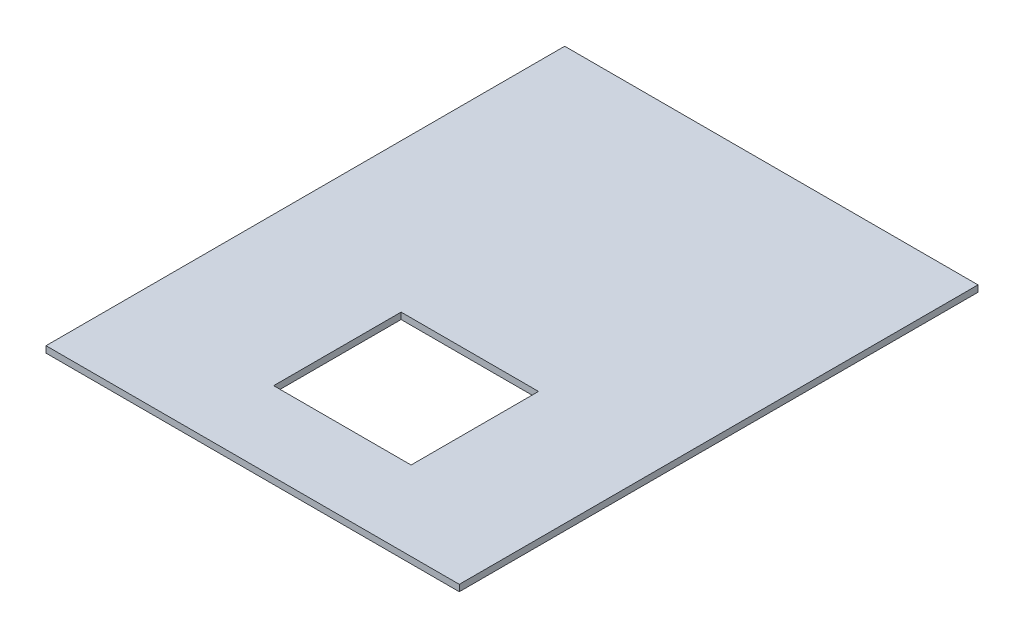
ISO-10303-21;
HEADER;
FILE_DESCRIPTION(('STEP AP214'),'2;1');
FILE_NAME('part.step','',(''),(''),'','','');
FILE_SCHEMA(('AUTOMOTIVE_DESIGN { 1 0 10303 214 1 1 1 1 }'));
ENDSEC;
DATA;
#1=APPLICATION_CONTEXT('core data for automotive mechanical design processes');
#2=APPLICATION_PROTOCOL_DEFINITION('international standard','automotive_design',2000,#1);
#3=PRODUCT_CONTEXT('',#1,'mechanical');
#4=PRODUCT('Part','Part','',(#3));
#5=PRODUCT_RELATED_PRODUCT_CATEGORY('part','',(#4));
#6=PRODUCT_DEFINITION_FORMATION('','',#4);
#7=PRODUCT_DEFINITION_CONTEXT('part definition',#1,'design');
#8=PRODUCT_DEFINITION('design','',#6,#7);
#9=PRODUCT_DEFINITION_SHAPE('','',#8);
#10=(LENGTH_UNIT() NAMED_UNIT(*) SI_UNIT(.MILLI.,.METRE.));
#11=(NAMED_UNIT(*) PLANE_ANGLE_UNIT() SI_UNIT($,.RADIAN.));
#12=(NAMED_UNIT(*) SI_UNIT($,.STERADIAN.) SOLID_ANGLE_UNIT());
#13=UNCERTAINTY_MEASURE_WITH_UNIT(LENGTH_MEASURE(1.E-05),#10,'distance_accuracy_value','');
#14=(GEOMETRIC_REPRESENTATION_CONTEXT(3) GLOBAL_UNCERTAINTY_ASSIGNED_CONTEXT((#13)) GLOBAL_UNIT_ASSIGNED_CONTEXT((#10,
#11,#12)) REPRESENTATION_CONTEXT('',''));
#15=CARTESIAN_POINT('',(0.,0.,0.));
#16=DIRECTION('',(0.,0.,1.));
#17=DIRECTION('',(1.,0.,0.));
#18=AXIS2_PLACEMENT_3D('',#15,#16,#17);
#19=CARTESIAN_POINT('',(0.,4.7625,0.));
#20=DIRECTION('',(0.,1.,0.));
#21=DIRECTION('',(0.,0.,1.));
#22=AXIS2_PLACEMENT_3D('',#19,#20,#21);
#23=PLANE('',#22);
#24=DIRECTION('',(0.,0.,1.));
#25=VECTOR('',#24,1.);
#26=CARTESIAN_POINT('',(-152.4,4.7625,-191.262));
#27=LINE('',#26,#25);
#28=CARTESIAN_POINT('',(-152.4,4.7625,-191.262));
#29=VERTEX_POINT('',#28);
#30=CARTESIAN_POINT('',(-152.4,4.7625,191.262));
#31=VERTEX_POINT('',#30);
#32=EDGE_CURVE('E134',#29,#31,#27,.T.);
#33=ORIENTED_EDGE('',*,*,#32,.T.);
#34=DIRECTION('',(1.,0.,0.));
#35=VECTOR('',#34,1.);
#36=CARTESIAN_POINT('',(-152.4,4.7625,191.262));
#37=LINE('',#36,#35);
#38=CARTESIAN_POINT('',(152.4,4.7625,191.262));
#39=VERTEX_POINT('',#38);
#40=EDGE_CURVE('E137',#31,#39,#37,.T.);
#41=ORIENTED_EDGE('',*,*,#40,.T.);
#42=DIRECTION('',(0.,0.,-1.));
#43=VECTOR('',#42,1.);
#44=CARTESIAN_POINT('',(152.4,4.7625,-191.262));
#45=LINE('',#44,#43);
#46=CARTESIAN_POINT('',(152.4,4.7625,-191.262));
#47=VERTEX_POINT('',#46);
#48=EDGE_CURVE('E140',#39,#47,#45,.T.);
#49=ORIENTED_EDGE('',*,*,#48,.T.);
#50=DIRECTION('',(-1.,0.,0.));
#51=VECTOR('',#50,1.);
#52=CARTESIAN_POINT('',(-152.4,4.7625,-191.262));
#53=LINE('',#52,#51);
#54=EDGE_CURVE('E142',#47,#29,#53,.T.);
#55=ORIENTED_EDGE('',*,*,#54,.T.);
#56=EDGE_LOOP('',(#33,#41,#49,#55));
#57=FACE_BOUND('',#56,.T.);
#58=DIRECTION('',(1.,0.,0.));
#59=VECTOR('',#58,1.);
#60=CARTESIAN_POINT('',(-42.926,4.7625,132.842));
#61=LINE('',#60,#59);
#62=CARTESIAN_POINT('',(-42.926,4.7625,132.842));
#63=VERTEX_POINT('',#62);
#64=CARTESIAN_POINT('',(58.42,4.7625,132.842));
#65=VERTEX_POINT('',#64);
#66=EDGE_CURVE('E106',#63,#65,#61,.T.);
#67=ORIENTED_EDGE('',*,*,#66,.F.);
#68=DIRECTION('',(0.,0.,1.));
#69=VECTOR('',#68,1.);
#70=CARTESIAN_POINT('',(-42.9260000000001,4.7625,38.862));
#71=LINE('',#70,#69);
#72=CARTESIAN_POINT('',(-42.9260000000001,4.7625,38.862));
#73=VERTEX_POINT('',#72);
#74=EDGE_CURVE('E98',#73,#63,#71,.T.);
#75=ORIENTED_EDGE('',*,*,#74,.F.);
#76=DIRECTION('',(-1.,0.,0.));
#77=VECTOR('',#76,1.);
#78=CARTESIAN_POINT('',(-42.9260000000001,4.7625,38.862));
#79=LINE('',#78,#77);
#80=CARTESIAN_POINT('',(58.42,4.7625,38.862));
#81=VERTEX_POINT('',#80);
#82=EDGE_CURVE('E120',#81,#73,#79,.T.);
#83=ORIENTED_EDGE('',*,*,#82,.F.);
#84=DIRECTION('',(0.,0.,-1.));
#85=VECTOR('',#84,1.);
#86=CARTESIAN_POINT('',(58.42,4.7625,38.862));
#87=LINE('',#86,#85);
#88=EDGE_CURVE('E118',#65,#81,#87,.T.);
#89=ORIENTED_EDGE('',*,*,#88,.F.);
#90=EDGE_LOOP('',(#67,#75,#83,#89));
#91=FACE_BOUND('',#90,.T.);
#92=ADVANCED_FACE('F33',(#57,#91),#23,.T.);
#93=CARTESIAN_POINT('',(0.,0.,0.));
#94=DIRECTION('',(0.,1.,0.));
#95=DIRECTION('',(0.,0.,1.));
#96=AXIS2_PLACEMENT_3D('',#93,#94,#95);
#97=PLANE('',#96);
#98=DIRECTION('',(0.,0.,1.));
#99=VECTOR('',#98,1.);
#100=CARTESIAN_POINT('',(-152.4,0.,-191.262));
#101=LINE('',#100,#99);
#102=CARTESIAN_POINT('',(-152.4,0.,-191.262));
#103=VERTEX_POINT('',#102);
#104=CARTESIAN_POINT('',(-152.4,0.,191.262));
#105=VERTEX_POINT('',#104);
#106=EDGE_CURVE('E114',#103,#105,#101,.T.);
#107=ORIENTED_EDGE('',*,*,#106,.F.);
#108=DIRECTION('',(-1.,0.,0.));
#109=VECTOR('',#108,1.);
#110=CARTESIAN_POINT('',(-152.4,0.,-191.262));
#111=LINE('',#110,#109);
#112=CARTESIAN_POINT('',(152.4,0.,-191.262));
#113=VERTEX_POINT('',#112);
#114=EDGE_CURVE('E138',#113,#103,#111,.T.);
#115=ORIENTED_EDGE('',*,*,#114,.F.);
#116=DIRECTION('',(0.,0.,-1.));
#117=VECTOR('',#116,1.);
#118=CARTESIAN_POINT('',(152.4,0.,-191.262));
#119=LINE('',#118,#117);
#120=CARTESIAN_POINT('',(152.4,0.,191.262));
#121=VERTEX_POINT('',#120);
#122=EDGE_CURVE('E149',#121,#113,#119,.T.);
#123=ORIENTED_EDGE('',*,*,#122,.F.);
#124=DIRECTION('',(1.,0.,0.));
#125=VECTOR('',#124,1.);
#126=CARTESIAN_POINT('',(-152.4,0.,191.262));
#127=LINE('',#126,#125);
#128=EDGE_CURVE('E147',#105,#121,#127,.T.);
#129=ORIENTED_EDGE('',*,*,#128,.F.);
#130=EDGE_LOOP('',(#107,#115,#123,#129));
#131=FACE_BOUND('',#130,.T.);
#132=DIRECTION('',(0.,0.,1.));
#133=VECTOR('',#132,1.);
#134=CARTESIAN_POINT('',(-42.9260000000001,0.,38.862));
#135=LINE('',#134,#133);
#136=CARTESIAN_POINT('',(-42.9260000000001,0.,38.862));
#137=VERTEX_POINT('',#136);
#138=CARTESIAN_POINT('',(-42.926,0.,132.842));
#139=VERTEX_POINT('',#138);
#140=EDGE_CURVE('E56',#137,#139,#135,.T.);
#141=ORIENTED_EDGE('',*,*,#140,.T.);
#142=DIRECTION('',(1.,0.,0.));
#143=VECTOR('',#142,1.);
#144=CARTESIAN_POINT('',(-42.926,0.,132.842));
#145=LINE('',#144,#143);
#146=CARTESIAN_POINT('',(58.42,0.,132.842));
#147=VERTEX_POINT('',#146);
#148=EDGE_CURVE('E113',#139,#147,#145,.T.);
#149=ORIENTED_EDGE('',*,*,#148,.T.);
#150=DIRECTION('',(0.,0.,-1.));
#151=VECTOR('',#150,1.);
#152=CARTESIAN_POINT('',(58.42,0.,38.862));
#153=LINE('',#152,#151);
#154=CARTESIAN_POINT('',(58.42,0.,38.862));
#155=VERTEX_POINT('',#154);
#156=EDGE_CURVE('E126',#147,#155,#153,.T.);
#157=ORIENTED_EDGE('',*,*,#156,.T.);
#158=DIRECTION('',(-1.,0.,0.));
#159=VECTOR('',#158,1.);
#160=CARTESIAN_POINT('',(-42.9260000000001,0.,38.862));
#161=LINE('',#160,#159);
#162=EDGE_CURVE('E107',#155,#137,#161,.T.);
#163=ORIENTED_EDGE('',*,*,#162,.T.);
#164=EDGE_LOOP('',(#141,#149,#157,#163));
#165=FACE_BOUND('',#164,.T.);
#166=ADVANCED_FACE('F167',(#131,#165),#97,.F.);
#167=CARTESIAN_POINT('',(-152.4,4.7625,-191.262));
#168=DIRECTION('',(1.,0.,0.));
#169=DIRECTION('',(0.,0.,-1.));
#170=AXIS2_PLACEMENT_3D('',#167,#168,#169);
#171=PLANE('',#170);
#172=ORIENTED_EDGE('',*,*,#106,.T.);
#173=DIRECTION('',(0.,-1.,0.));
#174=VECTOR('',#173,1.);
#175=CARTESIAN_POINT('',(-152.4,4.7625,191.262));
#176=LINE('',#175,#174);
#177=EDGE_CURVE('E11',#31,#105,#176,.T.);
#178=ORIENTED_EDGE('',*,*,#177,.F.);
#179=ORIENTED_EDGE('',*,*,#32,.F.);
#180=DIRECTION('',(0.,-1.,0.));
#181=VECTOR('',#180,1.);
#182=CARTESIAN_POINT('',(-152.4,4.7625,-191.262));
#183=LINE('',#182,#181);
#184=EDGE_CURVE('E144',#29,#103,#183,.T.);
#185=ORIENTED_EDGE('',*,*,#184,.T.);
#186=EDGE_LOOP('',(#172,#178,#179,#185));
#187=FACE_BOUND('',#186,.T.);
#188=ADVANCED_FACE('F35',(#187),#171,.F.);
#189=CARTESIAN_POINT('',(-152.4,4.7625,191.262));
#190=DIRECTION('',(0.,0.,-1.));
#191=DIRECTION('',(-1.,0.,0.));
#192=AXIS2_PLACEMENT_3D('',#189,#190,#191);
#193=PLANE('',#192);
#194=ORIENTED_EDGE('',*,*,#128,.T.);
#195=DIRECTION('',(0.,-1.,0.));
#196=VECTOR('',#195,1.);
#197=CARTESIAN_POINT('',(152.4,4.7625,191.262));
#198=LINE('',#197,#196);
#199=EDGE_CURVE('E41',#39,#121,#198,.T.);
#200=ORIENTED_EDGE('',*,*,#199,.F.);
#201=ORIENTED_EDGE('',*,*,#40,.F.);
#202=ORIENTED_EDGE('',*,*,#177,.T.);
#203=EDGE_LOOP('',(#194,#200,#201,#202));
#204=FACE_BOUND('',#203,.T.);
#205=ADVANCED_FACE('F177',(#204),#193,.F.);
#206=CARTESIAN_POINT('',(152.4,4.7625,-191.262));
#207=DIRECTION('',(-1.,0.,0.));
#208=DIRECTION('',(0.,0.,1.));
#209=AXIS2_PLACEMENT_3D('',#206,#207,#208);
#210=PLANE('',#209);
#211=ORIENTED_EDGE('',*,*,#122,.T.);
#212=DIRECTION('',(0.,-1.,0.));
#213=VECTOR('',#212,1.);
#214=CARTESIAN_POINT('',(152.4,4.7625,-191.262));
#215=LINE('',#214,#213);
#216=EDGE_CURVE('E154',#47,#113,#215,.T.);
#217=ORIENTED_EDGE('',*,*,#216,.F.);
#218=ORIENTED_EDGE('',*,*,#48,.F.);
#219=ORIENTED_EDGE('',*,*,#199,.T.);
#220=EDGE_LOOP('',(#211,#217,#218,#219));
#221=FACE_BOUND('',#220,.T.);
#222=ADVANCED_FACE('F161',(#221),#210,.F.);
#223=CARTESIAN_POINT('',(-152.4,4.7625,-191.262));
#224=DIRECTION('',(0.,0.,1.));
#225=DIRECTION('',(1.,0.,0.));
#226=AXIS2_PLACEMENT_3D('',#223,#224,#225);
#227=PLANE('',#226);
#228=ORIENTED_EDGE('',*,*,#114,.T.);
#229=ORIENTED_EDGE('',*,*,#184,.F.);
#230=ORIENTED_EDGE('',*,*,#54,.F.);
#231=ORIENTED_EDGE('',*,*,#216,.T.);
#232=EDGE_LOOP('',(#228,#229,#230,#231));
#233=FACE_BOUND('',#232,.T.);
#234=ADVANCED_FACE('F171',(#233),#227,.F.);
#235=CARTESIAN_POINT('',(-42.9260000000001,4.7625,38.862));
#236=DIRECTION('',(1.,0.,0.));
#237=DIRECTION('',(0.,0.,-1.));
#238=AXIS2_PLACEMENT_3D('',#235,#236,#237);
#239=PLANE('',#238);
#240=ORIENTED_EDGE('',*,*,#140,.F.);
#241=DIRECTION('',(0.,-1.,0.));
#242=VECTOR('',#241,1.);
#243=CARTESIAN_POINT('',(-42.9260000000001,4.7625,38.862));
#244=LINE('',#243,#242);
#245=EDGE_CURVE('E102',#73,#137,#244,.T.);
#246=ORIENTED_EDGE('',*,*,#245,.F.);
#247=ORIENTED_EDGE('',*,*,#74,.T.);
#248=DIRECTION('',(0.,-1.,0.));
#249=VECTOR('',#248,1.);
#250=CARTESIAN_POINT('',(-42.926,4.7625,132.842));
#251=LINE('',#250,#249);
#252=EDGE_CURVE('E101',#63,#139,#251,.T.);
#253=ORIENTED_EDGE('',*,*,#252,.T.);
#254=EDGE_LOOP('',(#240,#246,#247,#253));
#255=FACE_BOUND('',#254,.T.);
#256=ADVANCED_FACE('F100',(#255),#239,.T.);
#257=CARTESIAN_POINT('',(-42.926,4.7625,132.842));
#258=DIRECTION('',(0.,0.,-1.));
#259=DIRECTION('',(-1.,0.,0.));
#260=AXIS2_PLACEMENT_3D('',#257,#258,#259);
#261=PLANE('',#260);
#262=ORIENTED_EDGE('',*,*,#148,.F.);
#263=ORIENTED_EDGE('',*,*,#252,.F.);
#264=ORIENTED_EDGE('',*,*,#66,.T.);
#265=DIRECTION('',(0.,-1.,0.));
#266=VECTOR('',#265,1.);
#267=CARTESIAN_POINT('',(58.42,4.7625,132.842));
#268=LINE('',#267,#266);
#269=EDGE_CURVE('E115',#65,#147,#268,.T.);
#270=ORIENTED_EDGE('',*,*,#269,.T.);
#271=EDGE_LOOP('',(#262,#263,#264,#270));
#272=FACE_BOUND('',#271,.T.);
#273=ADVANCED_FACE('F110',(#272),#261,.T.);
#274=CARTESIAN_POINT('',(58.42,4.7625,38.862));
#275=DIRECTION('',(-1.,0.,0.));
#276=DIRECTION('',(0.,0.,1.));
#277=AXIS2_PLACEMENT_3D('',#274,#275,#276);
#278=PLANE('',#277);
#279=ORIENTED_EDGE('',*,*,#156,.F.);
#280=ORIENTED_EDGE('',*,*,#269,.F.);
#281=ORIENTED_EDGE('',*,*,#88,.T.);
#282=DIRECTION('',(0.,-1.,0.));
#283=VECTOR('',#282,1.);
#284=CARTESIAN_POINT('',(58.42,4.7625,38.862));
#285=LINE('',#284,#283);
#286=EDGE_CURVE('E48',#81,#155,#285,.T.);
#287=ORIENTED_EDGE('',*,*,#286,.T.);
#288=EDGE_LOOP('',(#279,#280,#281,#287));
#289=FACE_BOUND('',#288,.T.);
#290=ADVANCED_FACE('F200',(#289),#278,.T.);
#291=CARTESIAN_POINT('',(-42.9260000000001,4.7625,38.862));
#292=DIRECTION('',(0.,0.,1.));
#293=DIRECTION('',(1.,0.,0.));
#294=AXIS2_PLACEMENT_3D('',#291,#292,#293);
#295=PLANE('',#294);
#296=ORIENTED_EDGE('',*,*,#162,.F.);
#297=ORIENTED_EDGE('',*,*,#286,.F.);
#298=ORIENTED_EDGE('',*,*,#82,.T.);
#299=ORIENTED_EDGE('',*,*,#245,.T.);
#300=EDGE_LOOP('',(#296,#297,#298,#299));
#301=FACE_BOUND('',#300,.T.);
#302=ADVANCED_FACE('F204',(#301),#295,.T.);
#303=CLOSED_SHELL('',(#92,#166,#188,#205,#222,#234,#256,#273,#290,#302));
#304=MANIFOLD_SOLID_BREP('B2',#303);
#305=ADVANCED_BREP_SHAPE_REPRESENTATION('',(#18,#304),#14);
#306=SHAPE_DEFINITION_REPRESENTATION(#9,#305);
ENDSEC;
END-ISO-10303-21;
